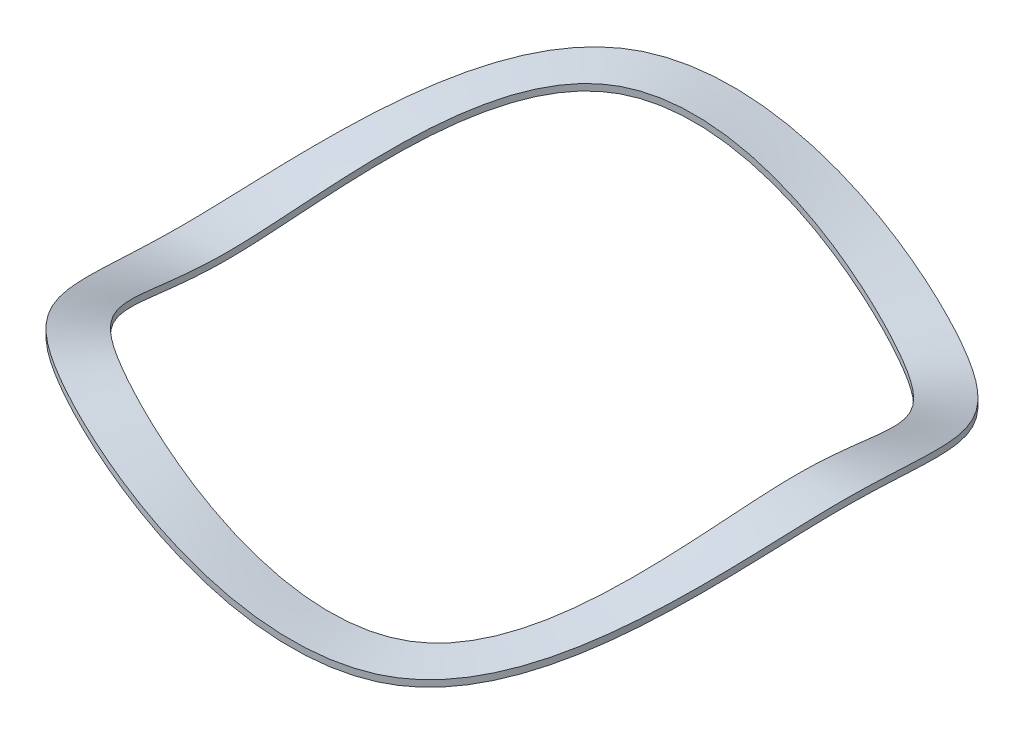
ISO-10303-21;
HEADER;
FILE_DESCRIPTION(('STEP AP214'),'2;1');
FILE_NAME('part.step','',(''),(''),'','','');
FILE_SCHEMA(('AUTOMOTIVE_DESIGN { 1 0 10303 214 1 1 1 1 }'));
ENDSEC;
DATA;
#1=APPLICATION_CONTEXT('core data for automotive mechanical design processes');
#2=APPLICATION_PROTOCOL_DEFINITION('international standard','automotive_design',2000,#1);
#3=PRODUCT_CONTEXT('',#1,'mechanical');
#4=PRODUCT('Part','Part','',(#3));
#5=PRODUCT_RELATED_PRODUCT_CATEGORY('part','',(#4));
#6=PRODUCT_DEFINITION_FORMATION('','',#4);
#7=PRODUCT_DEFINITION_CONTEXT('part definition',#1,'design');
#8=PRODUCT_DEFINITION('design','',#6,#7);
#9=PRODUCT_DEFINITION_SHAPE('','',#8);
#10=(LENGTH_UNIT() NAMED_UNIT(*) SI_UNIT(.MILLI.,.METRE.));
#11=(NAMED_UNIT(*) PLANE_ANGLE_UNIT() SI_UNIT($,.RADIAN.));
#12=(NAMED_UNIT(*) SI_UNIT($,.STERADIAN.) SOLID_ANGLE_UNIT());
#13=UNCERTAINTY_MEASURE_WITH_UNIT(LENGTH_MEASURE(1.E-05),#10,'distance_accuracy_value','');
#14=(GEOMETRIC_REPRESENTATION_CONTEXT(3) GLOBAL_UNCERTAINTY_ASSIGNED_CONTEXT((#13)) GLOBAL_UNIT_ASSIGNED_CONTEXT((#10,
#11,#12)) REPRESENTATION_CONTEXT('',''));
#15=CARTESIAN_POINT('',(0.,0.,0.));
#16=DIRECTION('',(0.,0.,1.));
#17=DIRECTION('',(1.,0.,0.));
#18=AXIS2_PLACEMENT_3D('',#15,#16,#17);
#19=CARTESIAN_POINT('',(-17.7546,0.,0.));
#20=CARTESIAN_POINT('',(-17.7546000000005,1.19396070179072E-12,-0.30751869268211));
#21=CARTESIAN_POINT('',(-17.7368454000016,0.0287020000037721,-0.922556078046613));
#22=CARTESIAN_POINT('',(-17.6582812950035,0.149250400008069,-1.84280576589896));
#23=CARTESIAN_POINT('',(-17.5291165800055,0.338683600012657,-2.75844267336164));
#24=CARTESIAN_POINT('',(-16.4585142000233,1.83692800003237,-8.21074909459633));
#25=CARTESIAN_POINT('',(-9.23239200016921,10.3327199999278,-18.4511215608123));
#26=CARTESIAN_POINT('',(10.6527600005029,-5.74040000001403,-18.4511215605249));
#27=CARTESIAN_POINT('',(21.3055199999069,11.4808000000723,-3.15599759867502E-10));
#28=CARTESIAN_POINT('',(10.6527600000534,-5.7403999999782,18.4511215608787));
#29=CARTESIAN_POINT('',(-9.23239200001469,10.3327200000052,18.4511215608173));
#30=CARTESIAN_POINT('',(-16.4585141999947,1.83692799998087,8.2107490945936));
#31=CARTESIAN_POINT('',(-17.529116579997,0.338683599991582,2.75844267335511));
#32=CARTESIAN_POINT('',(-17.6582812949977,0.149250399993841,1.84280576589605));
#33=CARTESIAN_POINT('',(-17.7368453999986,0.0287019999966051,0.922556078046043));
#34=CARTESIAN_POINT('',(-17.7545999999995,-1.19502626923836E-12,0.307518692682109));
#35=CARTESIAN_POINT('',(-17.7546,0.,0.));
#36=CARTESIAN_POINT('',(-17.9916666666667,0.,0.));
#37=CARTESIAN_POINT('',(-17.9916666666672,1.19396070179072E-12,-0.311624807796606));
#38=CARTESIAN_POINT('',(-17.9736750000016,0.0287020000037721,-0.934874423390106));
#39=CARTESIAN_POINT('',(-17.8940618750035,0.149250400008069,-1.8674116607226));
#40=CARTESIAN_POINT('',(-17.7631725000056,0.338683600012657,-2.79527452593872));
#41=CARTESIAN_POINT('',(-16.6782750000236,1.83692800003237,-8.32038236815317));
#42=CARTESIAN_POINT('',(-9.35566666683814,10.3327199999278,-18.6974884676806));
#43=CARTESIAN_POINT('',(10.7950000005096,-5.74040000001403,-18.6974884673893));
#44=CARTESIAN_POINT('',(21.5899999999056,11.4808000000723,-3.19814677128202E-10));
#45=CARTESIAN_POINT('',(10.7950000000541,-5.7403999999782,18.6974884677478));
#46=CARTESIAN_POINT('',(-9.35566666668156,10.3327200000052,18.6974884676856));
#47=CARTESIAN_POINT('',(-16.6782749999946,1.83692799998087,8.3203823681504));
#48=CARTESIAN_POINT('',(-17.763172499997,0.338683599991582,2.7952745259321));
#49=CARTESIAN_POINT('',(-17.8940618749976,0.149250399993841,1.86741166071965));
#50=CARTESIAN_POINT('',(-17.9736749999986,0.0287019999966051,0.934874423389529));
#51=CARTESIAN_POINT('',(-17.9916666666662,-1.19502626923836E-12,0.311624807796605));
#52=CARTESIAN_POINT('',(-17.9916666666667,0.,0.));
#53=CARTESIAN_POINT('',(-18.4658,0.,0.));
#54=CARTESIAN_POINT('',(-18.4658000000005,1.1943672776054E-12,-0.3198370380256));
#55=CARTESIAN_POINT('',(-18.4473342000017,0.0287020000037725,-0.959511114077094));
#56=CARTESIAN_POINT('',(-18.3656230350037,0.149250400008069,-1.91662345036989));
#57=CARTESIAN_POINT('',(-18.2312843400057,0.338683600012657,-2.86893823109287));
#58=CARTESIAN_POINT('',(-17.1177966000243,1.83692800003237,-8.53964891526687));
#59=CARTESIAN_POINT('',(-9.60221600017598,10.3327199999278,-19.1902222814171));
#60=CARTESIAN_POINT('',(11.079480000523,-5.74040000001403,-19.1902222811182));
#61=CARTESIAN_POINT('',(22.1589599999032,11.4808000000723,-3.28234916460377E-10));
#62=CARTESIAN_POINT('',(11.0794800000555,-5.7403999999782,19.1902222814862));
#63=CARTESIAN_POINT('',(-9.60221600001526,10.3327200000052,19.1902222814223));
#64=CARTESIAN_POINT('',(-17.1177965999945,1.83692799998087,8.53964891526403));
#65=CARTESIAN_POINT('',(-18.2312843399969,0.338683599991583,2.86893823108608));
#66=CARTESIAN_POINT('',(-18.3656230349976,0.149250399993842,1.91662345036685));
#67=CARTESIAN_POINT('',(-18.4473341999986,0.0287019999966055,0.959511114076502));
#68=CARTESIAN_POINT('',(-18.4657999999995,-1.19460952902831E-12,0.319837038025599));
#69=CARTESIAN_POINT('',(-18.4658,0.,0.));
#70=CARTESIAN_POINT('',(-19.177,0.,0.));
#71=CARTESIAN_POINT('',(-19.1770000000005,1.1943672776054E-12,-0.332155383369088));
#72=CARTESIAN_POINT('',(-19.1578230000017,0.0287020000037725,-0.996466150107571));
#73=CARTESIAN_POINT('',(-19.0729647750038,0.149250400008069,-1.9904411348408));
#74=CARTESIAN_POINT('',(-18.9334521000059,0.338683600012657,-2.97943378882409));
#75=CARTESIAN_POINT('',(-17.7770790000251,1.83692800003237,-8.86854873593737));
#76=CARTESIAN_POINT('',(-9.97204000018276,10.3327199999278,-19.9293230020218));
#77=CARTESIAN_POINT('',(11.5062000005432,-5.74040000001403,-19.9293230017114));
#78=CARTESIAN_POINT('',(23.0123999998994,11.4808000000723,-3.40897123897455E-10));
#79=CARTESIAN_POINT('',(11.5062000000577,-5.7403999999782,19.9293230020936));
#80=CARTESIAN_POINT('',(-9.97204000001588,10.3327200000052,19.9293230020272));
#81=CARTESIAN_POINT('',(-17.7770789999942,1.83692799998087,8.86854873593441));
#82=CARTESIAN_POINT('',(-18.9334520999968,0.338683599991583,2.97943378881703));
#83=CARTESIAN_POINT('',(-19.0729647749975,0.149250399993842,1.99044113483764));
#84=CARTESIAN_POINT('',(-19.1578229999985,0.0287019999966055,0.996466150106954));
#85=CARTESIAN_POINT('',(-19.1769999999994,-1.19460952902831E-12,0.332155383369087));
#86=CARTESIAN_POINT('',(-19.177,0.,0.));
#87=CARTESIAN_POINT('',(-19.8882,0.,0.));
#88=CARTESIAN_POINT('',(-19.8882000000006,1.19461969342368E-12,-0.344473728712578));
#89=CARTESIAN_POINT('',(-19.8683118000018,0.0287020000037727,-1.03342118613805));
#90=CARTESIAN_POINT('',(-19.7803065150039,0.149250400008069,-2.06425881931172));
#91=CARTESIAN_POINT('',(-19.6356198600061,0.338683600012657,-3.08992934655532));
#92=CARTESIAN_POINT('',(-18.4363614000261,1.83692800003237,-9.19744855660791));
#93=CARTESIAN_POINT('',(-10.3418640001895,10.3327199999278,-20.6684237226266));
#94=CARTESIAN_POINT('',(11.9329200005633,-5.74040000001402,-20.6684237223047));
#95=CARTESIAN_POINT('',(23.8658399998957,11.4808000000723,-3.53515773512253E-10));
#96=CARTESIAN_POINT('',(11.9329200000598,-5.74039999997819,20.668423722701));
#97=CARTESIAN_POINT('',(-10.3418640000165,10.3327200000052,20.6684237226323));
#98=CARTESIAN_POINT('',(-18.436361399994,1.83692799998087,9.19744855660485));
#99=CARTESIAN_POINT('',(-19.6356198599967,0.338683599991583,3.089929346548));
#100=CARTESIAN_POINT('',(-19.7803065149974,0.149250399993842,2.06425881930845));
#101=CARTESIAN_POINT('',(-19.8683117999985,0.0287019999966058,1.03342118613741));
#102=CARTESIAN_POINT('',(-19.8881999999995,-1.1943367844193E-12,0.344473728712577));
#103=CARTESIAN_POINT('',(-19.8882,0.,0.));
#104=CARTESIAN_POINT('',(-20.3623333333333,0.,0.));
#105=CARTESIAN_POINT('',(-20.3623333333339,1.19396070179072E-12,-0.352685958941571));
#106=CARTESIAN_POINT('',(-20.3419710000018,0.0287020000037721,-1.05805787682504));
#107=CARTESIAN_POINT('',(-20.251867675004,0.149250400008069,-2.11347060895899));
#108=CARTESIAN_POINT('',(-20.1037317000063,0.338683600012657,-3.16359305170947));
#109=CARTESIAN_POINT('',(-18.8758830000267,1.83692800003237,-9.41671510372159));
#110=CARTESIAN_POINT('',(-10.5884133335274,10.3327199999278,-21.1611575363632));
#111=CARTESIAN_POINT('',(12.2174000005767,-5.74040000001403,-21.1611575360335));
#112=CARTESIAN_POINT('',(24.4347999998932,11.4808000000723,-3.61953793760056E-10));
#113=CARTESIAN_POINT('',(12.2174000000613,-5.7403999999782,21.1611575364393));
#114=CARTESIAN_POINT('',(-10.5884133333502,10.3327200000052,21.1611575363689));
#115=CARTESIAN_POINT('',(-18.8758829999939,1.83692799998087,9.41671510371846));
#116=CARTESIAN_POINT('',(-20.1037316999966,0.338683599991582,3.16359305170198));
#117=CARTESIAN_POINT('',(-20.2518676749973,0.149250399993841,2.11347060895565));
#118=CARTESIAN_POINT('',(-20.3419709999984,0.0287019999966051,1.05805787682438));
#119=CARTESIAN_POINT('',(-20.3623333333328,-1.19502626923836E-12,0.35268595894157));
#120=CARTESIAN_POINT('',(-20.3623333333333,0.,0.));
#121=CARTESIAN_POINT('',(-20.5994,0.,0.));
#122=CARTESIAN_POINT('',(-20.5994000000006,1.19502796330426E-12,-0.356792074056067));
#123=CARTESIAN_POINT('',(-20.5788006000019,0.0287020000037731,-1.07037622216853));
#124=CARTESIAN_POINT('',(-20.4876482550041,0.14925040000807,-2.13807650378263));
#125=CARTESIAN_POINT('',(-20.3377876200064,0.338683600012658,-3.20042490428654));
#126=CARTESIAN_POINT('',(-19.095643800027,1.83692800003237,-9.52634837727843));
#127=CARTESIAN_POINT('',(-10.7116880001963,10.3327199999278,-21.4075244432314));
#128=CARTESIAN_POINT('',(12.3596400005835,-5.74040000001403,-21.407524442898));
#129=CARTESIAN_POINT('',(24.719279999892,11.4808000000723,-3.66168006289344E-10));
#130=CARTESIAN_POINT('',(12.359640000062,-5.7403999999782,21.4075244433085));
#131=CARTESIAN_POINT('',(-10.711688000017,10.3327200000052,21.4075244432372));
#132=CARTESIAN_POINT('',(-19.0956437999938,1.83692799998087,9.52634837727526));
#133=CARTESIAN_POINT('',(-20.3377876199965,0.338683599991584,3.20042490427897));
#134=CARTESIAN_POINT('',(-20.4876482549973,0.149250399993843,2.13807650377925));
#135=CARTESIAN_POINT('',(-20.5788005999984,0.0287019999966063,1.07037622216787));
#136=CARTESIAN_POINT('',(-20.5993999999994,-1.19389971541851E-12,0.356792074056066));
#137=CARTESIAN_POINT('',(-20.5994,0.,0.));
#138=B_SPLINE_SURFACE_WITH_KNOTS('',3,3,((#19,#20,#21,#22,#23,#24,#25,#26,#27,#28,#29,#30,#31,
#32,#33,#34,#35),(#36,#37,#38,#39,#40,#41,#42,#43,#44,#45,#46,#47,#48,#49,#50,#51,#52),(#53,#54,
#55,#56,#57,#58,#59,#60,#61,#62,#63,#64,#65,#66,#67,#68,#69),(#70,#71,#72,#73,#74,#75,#76,#77,
#78,#79,#80,#81,#82,#83,#84,#85,#86),(#87,#88,#89,#90,#91,#92,#93,#94,#95,#96,#97,#98,#99,#100,
#101,#102,#103),(#104,#105,#106,#107,#108,#109,#110,#111,#112,#113,#114,#115,#116,#117,#118,
#119,#120),(#121,#122,#123,#124,#125,#126,#127,#128,#129,#130,#131,#132,#133,#134,#135,#136,
#137)),.UNSPECIFIED.,.F.,.T.,.F.,(4,1,1,1,4),(4,1,1,1,1,1,1,1,1,1,1,1,1,1,4),(0.111111111111111,
0.305555555555556,0.5,0.694444444444444,0.888888888888889),(0.,0.0083333333333333,
0.0166666666666666,0.0250000000000001,0.0333333333333334,0.166666666665794,0.333333333328583,
0.5,0.666666666666667,0.833333333333334,0.966666666666667,0.975,0.983333333333333,
0.991666666666667,1.),.UNSPECIFIED.);
#139=CARTESIAN_POINT('',(-17.7546,0.,0.));
#140=CARTESIAN_POINT('',(-17.7546000000005,1.19396070179072E-12,-0.30751869268211));
#141=CARTESIAN_POINT('',(-17.7368454000016,0.0287020000037721,-0.922556078046613));
#142=CARTESIAN_POINT('',(-17.6582812950035,0.149250400008069,-1.84280576589896));
#143=CARTESIAN_POINT('',(-17.5291165800055,0.338683600012657,-2.75844267336164));
#144=CARTESIAN_POINT('',(-16.4585142000233,1.83692800003237,-8.21074909459633));
#145=CARTESIAN_POINT('',(-9.23239200016921,10.3327199999278,-18.4511215608123));
#146=CARTESIAN_POINT('',(10.6527600005029,-5.74040000001403,-18.4511215605249));
#147=CARTESIAN_POINT('',(21.3055199999069,11.4808000000723,-3.15599759867502E-10));
#148=CARTESIAN_POINT('',(10.6527600000534,-5.7403999999782,18.4511215608787));
#149=CARTESIAN_POINT('',(-9.23239200001469,10.3327200000052,18.4511215608173));
#150=CARTESIAN_POINT('',(-16.4585141999947,1.83692799998087,8.2107490945936));
#151=CARTESIAN_POINT('',(-17.529116579997,0.338683599991582,2.75844267335511));
#152=CARTESIAN_POINT('',(-17.6582812949977,0.149250399993841,1.84280576589605));
#153=CARTESIAN_POINT('',(-17.7368453999986,0.0287019999966051,0.922556078046043));
#154=CARTESIAN_POINT('',(-17.7545999999995,-1.19502626923836E-12,0.307518692682109));
#155=CARTESIAN_POINT('',(-17.7546,0.,0.));
#156=B_SPLINE_CURVE_WITH_KNOTS('',3,(#139,#140,#141,#142,#143,#144,#145,#146,#147,#148,#149,
#150,#151,#152,#153,#154,#155),.UNSPECIFIED.,.T.,.F.,(4,1,1,1,1,1,1,1,1,1,1,1,1,1,4),(0.,
0.0083333333333333,0.0166666666666666,0.0250000000000001,0.0333333333333334,0.166666666665794,
0.333333333328583,0.5,0.666666666666667,0.833333333333334,0.966666666666667,0.975,
0.983333333333333,0.991666666666667,1.),.UNSPECIFIED.);
#157=CARTESIAN_POINT('',(-17.7546,0.,0.));
#158=VERTEX_POINT('',#157);
#159=EDGE_CURVE('E32',#158,#158,#156,.T.);
#160=CARTESIAN_POINT('',(-20.5994,0.,0.));
#161=CARTESIAN_POINT('',(-20.5994000000006,1.19502796330426E-12,-0.356792074056067));
#162=CARTESIAN_POINT('',(-20.5788006000019,0.0287020000037731,-1.07037622216853));
#163=CARTESIAN_POINT('',(-20.4876482550041,0.14925040000807,-2.13807650378263));
#164=CARTESIAN_POINT('',(-20.3377876200064,0.338683600012658,-3.20042490428654));
#165=CARTESIAN_POINT('',(-19.095643800027,1.83692800003237,-9.52634837727843));
#166=CARTESIAN_POINT('',(-10.7116880001963,10.3327199999278,-21.4075244432314));
#167=CARTESIAN_POINT('',(12.3596400005835,-5.74040000001403,-21.407524442898));
#168=CARTESIAN_POINT('',(24.719279999892,11.4808000000723,-3.66168006289344E-10));
#169=CARTESIAN_POINT('',(12.359640000062,-5.7403999999782,21.4075244433085));
#170=CARTESIAN_POINT('',(-10.711688000017,10.3327200000052,21.4075244432372));
#171=CARTESIAN_POINT('',(-19.0956437999938,1.83692799998087,9.52634837727526));
#172=CARTESIAN_POINT('',(-20.3377876199965,0.338683599991584,3.20042490427897));
#173=CARTESIAN_POINT('',(-20.4876482549973,0.149250399993843,2.13807650377925));
#174=CARTESIAN_POINT('',(-20.5788005999984,0.0287019999966063,1.07037622216787));
#175=CARTESIAN_POINT('',(-20.5993999999994,-1.19389971541851E-12,0.356792074056066));
#176=CARTESIAN_POINT('',(-20.5994,0.,0.));
#177=B_SPLINE_CURVE_WITH_KNOTS('',3,(#160,#161,#162,#163,#164,#165,#166,#167,#168,#169,#170,
#171,#172,#173,#174,#175,#176),.UNSPECIFIED.,.T.,.F.,(4,1,1,1,1,1,1,1,1,1,1,1,1,1,4),(0.,
0.0083333333333333,0.0166666666666666,0.0250000000000001,0.0333333333333334,0.166666666665794,
0.333333333328583,0.5,0.666666666666667,0.833333333333334,0.966666666666667,0.975,
0.983333333333333,0.991666666666667,1.),.UNSPECIFIED.);
#178=CARTESIAN_POINT('',(-20.5994,0.,0.));
#179=VERTEX_POINT('',#178);
#180=EDGE_CURVE('E21',#179,#179,#177,.F.);
#181=ORIENTED_EDGE('',*,*,#159,.F.);
#182=EDGE_LOOP('',(#181));
#183=FACE_BOUND('',#182,.T.);
#184=ORIENTED_EDGE('',*,*,#180,.F.);
#185=EDGE_LOOP('',(#184));
#186=FACE_BOUND('',#185,.T.);
#187=ADVANCED_FACE('F15',(#183,#186),#138,.T.);
#188=CARTESIAN_POINT('',(-20.5994,0.,0.));
#189=CARTESIAN_POINT('',(-20.5994000000006,1.19502796330426E-12,-0.356792074056067));
#190=CARTESIAN_POINT('',(-20.5788006000019,0.0287020000037731,-1.07037622216853));
#191=CARTESIAN_POINT('',(-20.4876482550041,0.14925040000807,-2.13807650378263));
#192=CARTESIAN_POINT('',(-20.3377876200064,0.338683600012658,-3.20042490428654));
#193=CARTESIAN_POINT('',(-19.095643800027,1.83692800003237,-9.52634837727843));
#194=CARTESIAN_POINT('',(-10.7116880001963,10.3327199999278,-21.4075244432314));
#195=CARTESIAN_POINT('',(12.3596400005835,-5.74040000001403,-21.407524442898));
#196=CARTESIAN_POINT('',(24.719279999892,11.4808000000723,-3.66168006289344E-10));
#197=CARTESIAN_POINT('',(12.359640000062,-5.7403999999782,21.4075244433085));
#198=CARTESIAN_POINT('',(-10.711688000017,10.3327200000052,21.4075244432372));
#199=CARTESIAN_POINT('',(-19.0956437999938,1.83692799998087,9.52634837727526));
#200=CARTESIAN_POINT('',(-20.3377876199965,0.338683599991584,3.20042490427897));
#201=CARTESIAN_POINT('',(-20.4876482549973,0.149250399993843,2.13807650377925));
#202=CARTESIAN_POINT('',(-20.5788005999984,0.0287019999966063,1.07037622216787));
#203=CARTESIAN_POINT('',(-20.5993999999994,-1.19389971541851E-12,0.356792074056066));
#204=CARTESIAN_POINT('',(-20.5994,0.,0.));
#205=CARTESIAN_POINT('',(-20.5994,0.0338666666666671,0.));
#206=CARTESIAN_POINT('',(-20.5994000000006,0.0338666666678616,-0.356792074056067));
#207=CARTESIAN_POINT('',(-20.5788006000019,0.0625686666704397,-1.07037622216853));
#208=CARTESIAN_POINT('',(-20.4876482550041,0.183117066674736,-2.13807650378263));
#209=CARTESIAN_POINT('',(-20.3377876200064,0.372550266679324,-3.20042490428654));
#210=CARTESIAN_POINT('',(-19.095643800027,1.87079466669903,-9.52634837727843));
#211=CARTESIAN_POINT('',(-10.7116880001963,10.3665866665945,-21.4075244432314));
#212=CARTESIAN_POINT('',(12.3596400005835,-5.70653333334736,-21.407524442898));
#213=CARTESIAN_POINT('',(24.7192799998919,11.514666666739,-3.66165864990053E-10));
#214=CARTESIAN_POINT('',(12.359640000062,-5.70653333331153,21.4075244433085));
#215=CARTESIAN_POINT('',(-10.711688000017,10.3665866666719,21.4075244432372));
#216=CARTESIAN_POINT('',(-19.0956437999938,1.87079466664753,9.52634837727526));
#217=CARTESIAN_POINT('',(-20.3377876199965,0.37255026665825,3.20042490427897));
#218=CARTESIAN_POINT('',(-20.4876482549973,0.183117066660509,2.13807650377925));
#219=CARTESIAN_POINT('',(-20.5788005999984,0.0625686666632728,1.07037622216787));
#220=CARTESIAN_POINT('',(-20.5993999999994,0.0338666666654726,0.356792074056066));
#221=CARTESIAN_POINT('',(-20.5994,0.0338666666666671,0.));
#222=CARTESIAN_POINT('',(-20.5994,0.101599999999999,0.));
#223=CARTESIAN_POINT('',(-20.5994000000006,0.101600000001194,-0.356792074056068));
#224=CARTESIAN_POINT('',(-20.5788006000019,0.130302000003772,-1.07037622216853));
#225=CARTESIAN_POINT('',(-20.4876482550041,0.250850400008069,-2.13807650378264));
#226=CARTESIAN_POINT('',(-20.3377876200064,0.440283600012657,-3.20042490428654));
#227=CARTESIAN_POINT('',(-19.0956438000271,1.93852800003237,-9.52634837727844));
#228=CARTESIAN_POINT('',(-10.7116880001963,10.4343199999278,-21.4075244432315));
#229=CARTESIAN_POINT('',(12.3596400005835,-5.63880000001403,-21.4075244428979));
#230=CARTESIAN_POINT('',(24.719279999892,11.5824000000723,-3.66185353524104E-10));
#231=CARTESIAN_POINT('',(12.359640000062,-5.6387999999782,21.4075244433085));
#232=CARTESIAN_POINT('',(-10.711688000017,10.4343200000052,21.4075244432372));
#233=CARTESIAN_POINT('',(-19.0956437999939,1.93852799998087,9.52634837727526));
#234=CARTESIAN_POINT('',(-20.3377876199966,0.440283599991583,3.20042490427897));
#235=CARTESIAN_POINT('',(-20.4876482549973,0.250850399993842,2.13807650377925));
#236=CARTESIAN_POINT('',(-20.5788005999985,0.130301999996605,1.07037622216787));
#237=CARTESIAN_POINT('',(-20.5993999999995,0.101599999998805,0.356792074056066));
#238=CARTESIAN_POINT('',(-20.5994,0.101599999999999,0.));
#239=CARTESIAN_POINT('',(-20.5994,0.2032,0.));
#240=CARTESIAN_POINT('',(-20.5994000000006,0.203200000001195,-0.356792074056068));
#241=CARTESIAN_POINT('',(-20.5788006000018,0.231902000003773,-1.07037622216853));
#242=CARTESIAN_POINT('',(-20.487648255004,0.35245040000807,-2.13807650378263));
#243=CARTESIAN_POINT('',(-20.3377876200063,0.541883600012657,-3.20042490428654));
#244=CARTESIAN_POINT('',(-19.095643800027,2.04012800003237,-9.52634837727842));
#245=CARTESIAN_POINT('',(-10.7116880001963,10.5359199999278,-21.4075244432314));
#246=CARTESIAN_POINT('',(12.3596400005835,-5.53720000001403,-21.407524442898));
#247=CARTESIAN_POINT('',(24.7192799998919,11.6840000000724,-3.66146268035786E-10));
#248=CARTESIAN_POINT('',(12.359640000062,-5.5371999999782,21.4075244433084));
#249=CARTESIAN_POINT('',(-10.7116880000171,10.5359200000052,21.4075244432372));
#250=CARTESIAN_POINT('',(-19.0956437999938,2.04012799998087,9.52634837727526));
#251=CARTESIAN_POINT('',(-20.3377876199965,0.541883599991583,3.20042490427896));
#252=CARTESIAN_POINT('',(-20.4876482549973,0.352450399993842,2.13807650377925));
#253=CARTESIAN_POINT('',(-20.5788005999984,0.231901999996606,1.07037622216787));
#254=CARTESIAN_POINT('',(-20.5993999999994,0.203199999998806,0.356792074056066));
#255=CARTESIAN_POINT('',(-20.5994,0.2032,0.));
#256=CARTESIAN_POINT('',(-20.5994,0.304799999999999,0.));
#257=CARTESIAN_POINT('',(-20.5994000000006,0.304800000001194,-0.356792074056067));
#258=CARTESIAN_POINT('',(-20.5788006000019,0.333502000003772,-1.07037622216853));
#259=CARTESIAN_POINT('',(-20.4876482550041,0.454050400008068,-2.13807650378263));
#260=CARTESIAN_POINT('',(-20.3377876200064,0.643483600012656,-3.20042490428654));
#261=CARTESIAN_POINT('',(-19.0956438000271,2.14172800003237,-9.52634837727844));
#262=CARTESIAN_POINT('',(-10.7116880001963,10.6375199999278,-21.4075244432315));
#263=CARTESIAN_POINT('',(12.3596400005835,-5.43560000001403,-21.4075244428979));
#264=CARTESIAN_POINT('',(24.719279999892,11.7856000000723,-3.66186925617254E-10));
#265=CARTESIAN_POINT('',(12.359640000062,-5.4355999999782,21.4075244433085));
#266=CARTESIAN_POINT('',(-10.711688000017,10.6375200000052,21.4075244432372));
#267=CARTESIAN_POINT('',(-19.0956437999938,2.14172799998087,9.52634837727526));
#268=CARTESIAN_POINT('',(-20.3377876199966,0.643483599991582,3.20042490427897));
#269=CARTESIAN_POINT('',(-20.4876482549973,0.454050399993841,2.13807650377925));
#270=CARTESIAN_POINT('',(-20.5788005999984,0.333501999996605,1.07037622216787));
#271=CARTESIAN_POINT('',(-20.5993999999994,0.304799999998805,0.356792074056067));
#272=CARTESIAN_POINT('',(-20.5994,0.304799999999999,0.));
#273=CARTESIAN_POINT('',(-20.5994,0.372533333333333,0.));
#274=CARTESIAN_POINT('',(-20.5994000000006,0.372533333334528,-0.356792074056067));
#275=CARTESIAN_POINT('',(-20.5788006000019,0.401235333337106,-1.07037622216853));
#276=CARTESIAN_POINT('',(-20.4876482550041,0.521783733341403,-2.13807650378263));
#277=CARTESIAN_POINT('',(-20.3377876200064,0.711216933345991,-3.20042490428654));
#278=CARTESIAN_POINT('',(-19.095643800027,2.2094613333657,-9.52634837727843));
#279=CARTESIAN_POINT('',(-10.7116880001963,10.7052533332611,-21.4075244432314));
#280=CARTESIAN_POINT('',(12.3596400005835,-5.3678666666807,-21.407524442898));
#281=CARTESIAN_POINT('',(24.7192799998919,11.8533333334057,-3.66165864990053E-10));
#282=CARTESIAN_POINT('',(12.359640000062,-5.36786666664486,21.4075244433085));
#283=CARTESIAN_POINT('',(-10.711688000017,10.7052533333385,21.4075244432372));
#284=CARTESIAN_POINT('',(-19.0956437999938,2.2094613333142,9.52634837727526));
#285=CARTESIAN_POINT('',(-20.3377876199965,0.711216933324916,3.20042490427897));
#286=CARTESIAN_POINT('',(-20.4876482549973,0.521783733327176,2.13807650377925));
#287=CARTESIAN_POINT('',(-20.5788005999984,0.401235333329939,1.07037622216787));
#288=CARTESIAN_POINT('',(-20.5993999999994,0.372533333332139,0.356792074056066));
#289=CARTESIAN_POINT('',(-20.5994,0.372533333333333,0.));
#290=CARTESIAN_POINT('',(-20.5994,0.406399999999999,0.));
#291=CARTESIAN_POINT('',(-20.5994000000006,0.406400000001194,-0.356792074056068));
#292=CARTESIAN_POINT('',(-20.5788006000019,0.435102000003772,-1.07037622216853));
#293=CARTESIAN_POINT('',(-20.4876482550041,0.555650400008069,-2.13807650378263));
#294=CARTESIAN_POINT('',(-20.3377876200064,0.745083600012656,-3.20042490428654));
#295=CARTESIAN_POINT('',(-19.095643800027,2.24332800003237,-9.52634837727843));
#296=CARTESIAN_POINT('',(-10.7116880001963,10.7391199999278,-21.4075244432314));
#297=CARTESIAN_POINT('',(12.3596400005835,-5.33400000001403,-21.407524442898));
#298=CARTESIAN_POINT('',(24.719279999892,11.8872000000723,-3.66168765230865E-10));
#299=CARTESIAN_POINT('',(12.359640000062,-5.3339999999782,21.4075244433085));
#300=CARTESIAN_POINT('',(-10.711688000017,10.7391200000052,21.4075244432372));
#301=CARTESIAN_POINT('',(-19.0956437999938,2.24332799998087,9.52634837727526));
#302=CARTESIAN_POINT('',(-20.3377876199965,0.745083599991582,3.20042490427896));
#303=CARTESIAN_POINT('',(-20.4876482549973,0.555650399993841,2.13807650377925));
#304=CARTESIAN_POINT('',(-20.5788005999984,0.435101999996605,1.07037622216787));
#305=CARTESIAN_POINT('',(-20.5993999999994,0.406399999998805,0.356792074056065));
#306=CARTESIAN_POINT('',(-20.5994,0.406399999999999,0.));
#307=B_SPLINE_SURFACE_WITH_KNOTS('',3,3,((#188,#189,#190,#191,#192,#193,#194,#195,#196,#197,
#198,#199,#200,#201,#202,#203,#204),(#205,#206,#207,#208,#209,#210,#211,#212,#213,#214,#215,
#216,#217,#218,#219,#220,#221),(#222,#223,#224,#225,#226,#227,#228,#229,#230,#231,#232,#233,
#234,#235,#236,#237,#238),(#239,#240,#241,#242,#243,#244,#245,#246,#247,#248,#249,#250,#251,
#252,#253,#254,#255),(#256,#257,#258,#259,#260,#261,#262,#263,#264,#265,#266,#267,#268,#269,
#270,#271,#272),(#273,#274,#275,#276,#277,#278,#279,#280,#281,#282,#283,#284,#285,#286,#287,
#288,#289),(#290,#291,#292,#293,#294,#295,#296,#297,#298,#299,#300,#301,#302,#303,#304,#305,
#306)),.UNSPECIFIED.,.F.,.T.,.F.,(4,1,1,1,4),(4,1,1,1,1,1,1,1,1,1,1,1,1,1,4),(0.888888888888889,
0.916666666666667,0.944444444444444,0.972222222222222,1.),(0.,0.0083333333333333,
0.0166666666666666,0.0250000000000001,0.0333333333333334,0.166666666665794,0.333333333328583,
0.5,0.666666666666667,0.833333333333334,0.966666666666667,0.975,0.983333333333333,
0.991666666666667,1.),.UNSPECIFIED.);
#308=CARTESIAN_POINT('',(-20.5994,0.4064,0.));
#309=CARTESIAN_POINT('',(-20.5994000000006,0.406400000001195,-0.356792074056068));
#310=CARTESIAN_POINT('',(-20.5788006000019,0.435102000003773,-1.07037622216853));
#311=CARTESIAN_POINT('',(-20.4876482550041,0.555650400008069,-2.13807650378263));
#312=CARTESIAN_POINT('',(-20.3377876200064,0.745083600012657,-3.20042490428654));
#313=CARTESIAN_POINT('',(-19.095643800027,2.24332800003237,-9.52634837727843));
#314=CARTESIAN_POINT('',(-10.7116880001963,10.7391199999278,-21.4075244432314));
#315=CARTESIAN_POINT('',(12.3596400005835,-5.33400000001403,-21.407524442898));
#316=CARTESIAN_POINT('',(24.719279999892,11.8872000000723,-3.66168765230865E-10));
#317=CARTESIAN_POINT('',(12.359640000062,-5.3339999999782,21.4075244433085));
#318=CARTESIAN_POINT('',(-10.711688000017,10.7391200000052,21.4075244432372));
#319=CARTESIAN_POINT('',(-19.0956437999938,2.24332799998087,9.52634837727526));
#320=CARTESIAN_POINT('',(-20.3377876199965,0.745083599991583,3.20042490427896));
#321=CARTESIAN_POINT('',(-20.4876482549973,0.555650399993842,2.13807650377925));
#322=CARTESIAN_POINT('',(-20.5788005999984,0.435101999996606,1.07037622216787));
#323=CARTESIAN_POINT('',(-20.5993999999994,0.406399999998806,0.356792074056065));
#324=CARTESIAN_POINT('',(-20.5994,0.4064,0.));
#325=B_SPLINE_CURVE_WITH_KNOTS('',3,(#308,#309,#310,#311,#312,#313,#314,#315,#316,#317,#318,
#319,#320,#321,#322,#323,#324),.UNSPECIFIED.,.T.,.F.,(4,1,1,1,1,1,1,1,1,1,1,1,1,1,4),(0.,
0.0083333333333333,0.0166666666666666,0.0250000000000001,0.0333333333333334,0.166666666665794,
0.333333333328583,0.5,0.666666666666667,0.833333333333334,0.966666666666667,0.975,
0.983333333333333,0.991666666666667,1.),.UNSPECIFIED.);
#326=CARTESIAN_POINT('',(-20.5994,0.4064,0.));
#327=VERTEX_POINT('',#326);
#328=EDGE_CURVE('E27',#327,#327,#325,.F.);
#329=ORIENTED_EDGE('',*,*,#180,.T.);
#330=EDGE_LOOP('',(#329));
#331=FACE_BOUND('',#330,.T.);
#332=ORIENTED_EDGE('',*,*,#328,.F.);
#333=EDGE_LOOP('',(#332));
#334=FACE_BOUND('',#333,.T.);
#335=ADVANCED_FACE('F55',(#331,#334),#307,.T.);
#336=CARTESIAN_POINT('',(-17.7546,0.406399999999999,0.));
#337=CARTESIAN_POINT('',(-17.7546000000005,0.406400000001194,-0.30751869268211));
#338=CARTESIAN_POINT('',(-17.7368454000016,0.435102000003772,-0.922556078046613));
#339=CARTESIAN_POINT('',(-17.6582812950035,0.555650400008069,-1.84280576589896));
#340=CARTESIAN_POINT('',(-17.5291165800055,0.745083600012656,-2.75844267336164));
#341=CARTESIAN_POINT('',(-16.4585142000233,2.24332800003237,-8.21074909459633));
#342=CARTESIAN_POINT('',(-9.23239200016921,10.7391199999278,-18.4511215608123));
#343=CARTESIAN_POINT('',(10.6527600005029,-5.33400000001403,-18.4511215605249));
#344=CARTESIAN_POINT('',(21.3055199999069,11.8872000000723,-3.15599705657393E-10));
#345=CARTESIAN_POINT('',(10.6527600000534,-5.3339999999782,18.4511215608787));
#346=CARTESIAN_POINT('',(-9.2323920000147,10.7391200000052,18.4511215608173));
#347=CARTESIAN_POINT('',(-16.4585141999947,2.24332799998087,8.2107490945936));
#348=CARTESIAN_POINT('',(-17.529116579997,0.745083599991582,2.75844267335511));
#349=CARTESIAN_POINT('',(-17.6582812949977,0.555650399993841,1.84280576589605));
#350=CARTESIAN_POINT('',(-17.7368453999986,0.435101999996605,0.922556078046043));
#351=CARTESIAN_POINT('',(-17.7545999999995,0.406399999998805,0.307518692682109));
#352=CARTESIAN_POINT('',(-17.7546,0.406399999999999,0.));
#353=CARTESIAN_POINT('',(-17.7546,0.372533333333333,0.));
#354=CARTESIAN_POINT('',(-17.7546000000005,0.372533333334528,-0.30751869268211));
#355=CARTESIAN_POINT('',(-17.7368454000016,0.401235333337106,-0.922556078046613));
#356=CARTESIAN_POINT('',(-17.6582812950035,0.521783733341402,-1.84280576589897));
#357=CARTESIAN_POINT('',(-17.5291165800055,0.71121693334599,-2.75844267336164));
#358=CARTESIAN_POINT('',(-16.4585142000233,2.2094613333657,-8.21074909459633));
#359=CARTESIAN_POINT('',(-9.23239200016921,10.7052533332611,-18.4511215608123));
#360=CARTESIAN_POINT('',(10.6527600005029,-5.3678666666807,-18.4511215605249));
#361=CARTESIAN_POINT('',(21.3055199999069,11.8533333334057,-3.15599678552339E-10));
#362=CARTESIAN_POINT('',(10.6527600000534,-5.36786666664486,18.4511215608787));
#363=CARTESIAN_POINT('',(-9.2323920000147,10.7052533333385,18.4511215608173));
#364=CARTESIAN_POINT('',(-16.4585141999947,2.2094613333142,8.2107490945936));
#365=CARTESIAN_POINT('',(-17.529116579997,0.711216933324916,2.75844267335511));
#366=CARTESIAN_POINT('',(-17.6582812949977,0.521783733327175,1.84280576589605));
#367=CARTESIAN_POINT('',(-17.7368453999986,0.401235333329939,0.922556078046043));
#368=CARTESIAN_POINT('',(-17.7545999999995,0.372533333332139,0.307518692682108));
#369=CARTESIAN_POINT('',(-17.7546,0.372533333333333,0.));
#370=CARTESIAN_POINT('',(-17.7546,0.3048,0.));
#371=CARTESIAN_POINT('',(-17.7546000000005,0.304800000001194,-0.30751869268211));
#372=CARTESIAN_POINT('',(-17.7368454000016,0.333502000003772,-0.922556078046613));
#373=CARTESIAN_POINT('',(-17.6582812950035,0.454050400008069,-1.84280576589896));
#374=CARTESIAN_POINT('',(-17.5291165800055,0.643483600012657,-2.75844267336164));
#375=CARTESIAN_POINT('',(-16.4585142000233,2.14172800003237,-8.21074909459633));
#376=CARTESIAN_POINT('',(-9.23239200016918,10.6375199999278,-18.4511215608123));
#377=CARTESIAN_POINT('',(10.6527600005029,-5.43560000001404,-18.4511215605248));
#378=CARTESIAN_POINT('',(21.3055199999069,11.7856000000724,-3.15606969811949E-10));
#379=CARTESIAN_POINT('',(10.6527600000534,-5.4355999999782,18.4511215608787));
#380=CARTESIAN_POINT('',(-9.23239200001467,10.6375200000052,18.4511215608173));
#381=CARTESIAN_POINT('',(-16.4585141999947,2.14172799998087,8.21074909459359));
#382=CARTESIAN_POINT('',(-17.529116579997,0.643483599991583,2.75844267335511));
#383=CARTESIAN_POINT('',(-17.6582812949977,0.454050399993842,1.84280576589605));
#384=CARTESIAN_POINT('',(-17.7368453999986,0.333501999996605,0.922556078046042));
#385=CARTESIAN_POINT('',(-17.7545999999995,0.304799999998805,0.307518692682108));
#386=CARTESIAN_POINT('',(-17.7546,0.3048,0.));
#387=CARTESIAN_POINT('',(-17.7546,0.203200000000001,0.));
#388=CARTESIAN_POINT('',(-17.7546000000005,0.203200000001196,-0.30751869268211));
#389=CARTESIAN_POINT('',(-17.7368454000016,0.231902000003774,-0.922556078046613));
#390=CARTESIAN_POINT('',(-17.6582812950035,0.352450400008071,-1.84280576589897));
#391=CARTESIAN_POINT('',(-17.5291165800055,0.541883600012659,-2.75844267336164));
#392=CARTESIAN_POINT('',(-16.4585142000233,2.04012800003237,-8.21074909459633));
#393=CARTESIAN_POINT('',(-9.23239200016925,10.5359199999278,-18.4511215608123));
#394=CARTESIAN_POINT('',(10.6527600005029,-5.53720000001403,-18.4511215605249));
#395=CARTESIAN_POINT('',(21.3055199999069,11.6840000000723,-3.15592820973598E-10));
#396=CARTESIAN_POINT('',(10.6527600000535,-5.53719999997819,18.4511215608787));
#397=CARTESIAN_POINT('',(-9.23239200001473,10.5359200000052,18.4511215608173));
#398=CARTESIAN_POINT('',(-16.4585141999947,2.04012799998087,8.21074909459361));
#399=CARTESIAN_POINT('',(-17.5291165799971,0.541883599991583,2.75844267335512));
#400=CARTESIAN_POINT('',(-17.6582812949977,0.352450399993842,1.84280576589605));
#401=CARTESIAN_POINT('',(-17.7368453999987,0.231901999996607,0.922556078046044));
#402=CARTESIAN_POINT('',(-17.7545999999995,0.203199999998807,0.307518692682109));
#403=CARTESIAN_POINT('',(-17.7546,0.203200000000001,0.));
#404=CARTESIAN_POINT('',(-17.7546,0.101599999999999,0.));
#405=CARTESIAN_POINT('',(-17.7546000000005,0.101600000001193,-0.30751869268211));
#406=CARTESIAN_POINT('',(-17.7368454000016,0.130302000003771,-0.922556078046613));
#407=CARTESIAN_POINT('',(-17.6582812950035,0.250850400008068,-1.84280576589896));
#408=CARTESIAN_POINT('',(-17.5291165800054,0.440283600012656,-2.75844267336164));
#409=CARTESIAN_POINT('',(-16.4585142000233,1.93852800003237,-8.21074909459633));
#410=CARTESIAN_POINT('',(-9.23239200016918,10.4343199999278,-18.4511215608123));
#411=CARTESIAN_POINT('',(10.6527600005029,-5.63880000001403,-18.4511215605248));
#412=CARTESIAN_POINT('',(21.3055199999068,11.5824000000723,-3.15611360830748E-10));
#413=CARTESIAN_POINT('',(10.6527600000534,-5.6387999999782,18.4511215608787));
#414=CARTESIAN_POINT('',(-9.23239200001467,10.4343200000052,18.4511215608172));
#415=CARTESIAN_POINT('',(-16.4585141999946,1.93852799998087,8.21074909459359));
#416=CARTESIAN_POINT('',(-17.529116579997,0.440283599991582,2.75844267335511));
#417=CARTESIAN_POINT('',(-17.6582812949976,0.250850399993841,1.84280576589605));
#418=CARTESIAN_POINT('',(-17.7368453999986,0.130301999996605,0.922556078046042));
#419=CARTESIAN_POINT('',(-17.7545999999995,0.101599999998805,0.307518692682108));
#420=CARTESIAN_POINT('',(-17.7546,0.101599999999999,0.));
#421=CARTESIAN_POINT('',(-17.7546,0.0338666666666667,0.));
#422=CARTESIAN_POINT('',(-17.7546000000005,0.0338666666678612,-0.30751869268211));
#423=CARTESIAN_POINT('',(-17.7368454000016,0.0625686666704393,-0.922556078046613));
#424=CARTESIAN_POINT('',(-17.6582812950035,0.183117066674736,-1.84280576589896));
#425=CARTESIAN_POINT('',(-17.5291165800055,0.372550266679324,-2.75844267336164));
#426=CARTESIAN_POINT('',(-16.4585142000233,1.87079466669904,-8.21074909459633));
#427=CARTESIAN_POINT('',(-9.23239200016921,10.3665866665945,-18.4511215608123));
#428=CARTESIAN_POINT('',(10.6527600005029,-5.70653333334736,-18.4511215605249));
#429=CARTESIAN_POINT('',(21.3055199999069,11.514666666739,-3.15599732762448E-10));
#430=CARTESIAN_POINT('',(10.6527600000534,-5.70653333331153,18.4511215608787));
#431=CARTESIAN_POINT('',(-9.23239200001469,10.3665866666719,18.4511215608173));
#432=CARTESIAN_POINT('',(-16.4585141999947,1.87079466664753,8.2107490945936));
#433=CARTESIAN_POINT('',(-17.529116579997,0.372550266658249,2.75844267335511));
#434=CARTESIAN_POINT('',(-17.6582812949977,0.183117066660509,1.84280576589605));
#435=CARTESIAN_POINT('',(-17.7368453999986,0.0625686666632723,0.922556078046043));
#436=CARTESIAN_POINT('',(-17.7545999999995,0.0338666666654722,0.307518692682108));
#437=CARTESIAN_POINT('',(-17.7546,0.0338666666666667,0.));
#438=CARTESIAN_POINT('',(-17.7546,0.,0.));
#439=CARTESIAN_POINT('',(-17.7546000000005,1.19396070179072E-12,-0.30751869268211));
#440=CARTESIAN_POINT('',(-17.7368454000016,0.0287020000037721,-0.922556078046613));
#441=CARTESIAN_POINT('',(-17.6582812950035,0.149250400008069,-1.84280576589896));
#442=CARTESIAN_POINT('',(-17.5291165800055,0.338683600012657,-2.75844267336164));
#443=CARTESIAN_POINT('',(-16.4585142000233,1.83692800003237,-8.21074909459633));
#444=CARTESIAN_POINT('',(-9.23239200016921,10.3327199999278,-18.4511215608123));
#445=CARTESIAN_POINT('',(10.6527600005029,-5.74040000001403,-18.4511215605249));
#446=CARTESIAN_POINT('',(21.3055199999069,11.4808000000723,-3.15599759867502E-10));
#447=CARTESIAN_POINT('',(10.6527600000534,-5.7403999999782,18.4511215608787));
#448=CARTESIAN_POINT('',(-9.23239200001469,10.3327200000052,18.4511215608173));
#449=CARTESIAN_POINT('',(-16.4585141999947,1.83692799998087,8.2107490945936));
#450=CARTESIAN_POINT('',(-17.529116579997,0.338683599991582,2.75844267335511));
#451=CARTESIAN_POINT('',(-17.6582812949977,0.149250399993841,1.84280576589605));
#452=CARTESIAN_POINT('',(-17.7368453999986,0.0287019999966051,0.922556078046043));
#453=CARTESIAN_POINT('',(-17.7545999999995,-1.19502626923836E-12,0.307518692682109));
#454=CARTESIAN_POINT('',(-17.7546,0.,0.));
#455=B_SPLINE_SURFACE_WITH_KNOTS('',3,3,((#336,#337,#338,#339,#340,#341,#342,#343,#344,#345,
#346,#347,#348,#349,#350,#351,#352),(#353,#354,#355,#356,#357,#358,#359,#360,#361,#362,#363,
#364,#365,#366,#367,#368,#369),(#370,#371,#372,#373,#374,#375,#376,#377,#378,#379,#380,#381,
#382,#383,#384,#385,#386),(#387,#388,#389,#390,#391,#392,#393,#394,#395,#396,#397,#398,#399,
#400,#401,#402,#403),(#404,#405,#406,#407,#408,#409,#410,#411,#412,#413,#414,#415,#416,#417,
#418,#419,#420),(#421,#422,#423,#424,#425,#426,#427,#428,#429,#430,#431,#432,#433,#434,#435,
#436,#437),(#438,#439,#440,#441,#442,#443,#444,#445,#446,#447,#448,#449,#450,#451,#452,#453,
#454)),.UNSPECIFIED.,.F.,.T.,.F.,(4,1,1,1,4),(4,1,1,1,1,1,1,1,1,1,1,1,1,1,4),(0.,
0.0277777777777778,0.0555555555555556,0.0833333333333333,0.111111111111111),(0.,
0.0083333333333333,0.0166666666666666,0.0250000000000001,0.0333333333333334,0.166666666665794,
0.333333333328583,0.5,0.666666666666667,0.833333333333334,0.966666666666667,0.975,
0.983333333333333,0.991666666666667,1.),.UNSPECIFIED.);
#456=CARTESIAN_POINT('',(-17.7546,0.4064,0.));
#457=CARTESIAN_POINT('',(-17.7546000000005,0.406400000001195,-0.30751869268211));
#458=CARTESIAN_POINT('',(-17.7368454000016,0.435102000003773,-0.922556078046613));
#459=CARTESIAN_POINT('',(-17.6582812950035,0.55565040000807,-1.84280576589896));
#460=CARTESIAN_POINT('',(-17.5291165800055,0.745083600012657,-2.75844267336164));
#461=CARTESIAN_POINT('',(-16.4585142000233,2.24332800003237,-8.21074909459633));
#462=CARTESIAN_POINT('',(-9.23239200016921,10.7391199999278,-18.4511215608123));
#463=CARTESIAN_POINT('',(10.6527600005029,-5.33400000001403,-18.4511215605249));
#464=CARTESIAN_POINT('',(21.3055199999069,11.8872000000723,-3.15599705657393E-10));
#465=CARTESIAN_POINT('',(10.6527600000534,-5.3339999999782,18.4511215608787));
#466=CARTESIAN_POINT('',(-9.2323920000147,10.7391200000052,18.4511215608173));
#467=CARTESIAN_POINT('',(-16.4585141999947,2.24332799998087,8.2107490945936));
#468=CARTESIAN_POINT('',(-17.529116579997,0.745083599991583,2.75844267335511));
#469=CARTESIAN_POINT('',(-17.6582812949977,0.555650399993842,1.84280576589605));
#470=CARTESIAN_POINT('',(-17.7368453999986,0.435101999996606,0.922556078046043));
#471=CARTESIAN_POINT('',(-17.7545999999995,0.406399999998806,0.307518692682109));
#472=CARTESIAN_POINT('',(-17.7546,0.4064,0.));
#473=B_SPLINE_CURVE_WITH_KNOTS('',3,(#456,#457,#458,#459,#460,#461,#462,#463,#464,#465,#466,
#467,#468,#469,#470,#471,#472),.UNSPECIFIED.,.T.,.F.,(4,1,1,1,1,1,1,1,1,1,1,1,1,1,4),(0.,
0.0083333333333333,0.0166666666666666,0.0250000000000001,0.0333333333333334,0.166666666665794,
0.333333333328583,0.5,0.666666666666667,0.833333333333334,0.966666666666667,0.975,
0.983333333333333,0.991666666666667,1.),.UNSPECIFIED.);
#474=CARTESIAN_POINT('',(-17.7546,0.4064,0.));
#475=VERTEX_POINT('',#474);
#476=EDGE_CURVE('E10',#475,#475,#473,.T.);
#477=ORIENTED_EDGE('',*,*,#159,.T.);
#478=EDGE_LOOP('',(#477));
#479=FACE_BOUND('',#478,.T.);
#480=ORIENTED_EDGE('',*,*,#476,.F.);
#481=EDGE_LOOP('',(#480));
#482=FACE_BOUND('',#481,.T.);
#483=ADVANCED_FACE('F65',(#479,#482),#455,.T.);
#484=CARTESIAN_POINT('',(-20.5994,0.4064,0.));
#485=CARTESIAN_POINT('',(-20.5994000000006,0.406400000001195,-0.356792074056068));
#486=CARTESIAN_POINT('',(-20.5788006000019,0.435102000003773,-1.07037622216853));
#487=CARTESIAN_POINT('',(-20.4876482550041,0.555650400008069,-2.13807650378263));
#488=CARTESIAN_POINT('',(-20.3377876200064,0.745083600012657,-3.20042490428654));
#489=CARTESIAN_POINT('',(-19.095643800027,2.24332800003237,-9.52634837727843));
#490=CARTESIAN_POINT('',(-10.7116880001963,10.7391199999278,-21.4075244432314));
#491=CARTESIAN_POINT('',(12.3596400005835,-5.33400000001403,-21.407524442898));
#492=CARTESIAN_POINT('',(24.719279999892,11.8872000000723,-3.66168765230865E-10));
#493=CARTESIAN_POINT('',(12.359640000062,-5.3339999999782,21.4075244433085));
#494=CARTESIAN_POINT('',(-10.711688000017,10.7391200000052,21.4075244432372));
#495=CARTESIAN_POINT('',(-19.0956437999938,2.24332799998087,9.52634837727526));
#496=CARTESIAN_POINT('',(-20.3377876199965,0.745083599991583,3.20042490427896));
#497=CARTESIAN_POINT('',(-20.4876482549973,0.555650399993842,2.13807650377925));
#498=CARTESIAN_POINT('',(-20.5788005999984,0.435101999996606,1.07037622216787));
#499=CARTESIAN_POINT('',(-20.5993999999994,0.406399999998806,0.356792074056065));
#500=CARTESIAN_POINT('',(-20.5994,0.4064,0.));
#501=CARTESIAN_POINT('',(-19.6511333333333,0.4064,0.));
#502=CARTESIAN_POINT('',(-19.6511333333339,0.406400000001195,-0.340367613598082));
#503=CARTESIAN_POINT('',(-19.6314822000018,0.435102000003773,-1.02110284079456));
#504=CARTESIAN_POINT('',(-19.5445259350039,0.555650400008069,-2.03965292448808));
#505=CARTESIAN_POINT('',(-19.4015639400061,0.745083600012657,-3.05309749397824));
#506=CARTESIAN_POINT('',(-18.2166006000258,2.24332800003237,-9.08781528305106));
#507=CARTESIAN_POINT('',(-10.2185893335206,10.7391199999278,-20.4220568157584));
#508=CARTESIAN_POINT('',(11.7906800005566,-5.33400000001403,-20.4220568154403));
#509=CARTESIAN_POINT('',(23.5813599998969,11.8872000000723,-3.49313812467514E-10));
#510=CARTESIAN_POINT('',(11.7906800000591,-5.3339999999782,20.4220568158319));
#511=CARTESIAN_POINT('',(-10.2185893333496,10.7391200000052,20.4220568157639));
#512=CARTESIAN_POINT('',(-18.2166005999941,2.24332799998087,9.08781528304804));
#513=CARTESIAN_POINT('',(-19.4015639399967,0.745083599991583,3.05309749397102));
#514=CARTESIAN_POINT('',(-19.5445259349974,0.555650399993842,2.03965292448485));
#515=CARTESIAN_POINT('',(-19.6314821999985,0.435101999996606,1.02110284079393));
#516=CARTESIAN_POINT('',(-19.6511333333328,0.406399999998806,0.34036761359808));
#517=CARTESIAN_POINT('',(-19.6511333333333,0.4064,0.));
#518=CARTESIAN_POINT('',(-18.7028666666667,0.4064,0.));
#519=CARTESIAN_POINT('',(-18.7028666666672,0.406400000001195,-0.323943153140095));
#520=CARTESIAN_POINT('',(-18.6841638000017,0.435102000003773,-0.971829459420585));
#521=CARTESIAN_POINT('',(-18.6014036150037,0.55565040000807,-1.94122934519352));
#522=CARTESIAN_POINT('',(-18.4653402600058,0.745083600012657,-2.90577008366994));
#523=CARTESIAN_POINT('',(-17.3375574000245,2.24332800003237,-8.6492821888237));
#524=CARTESIAN_POINT('',(-9.72549066684491,10.7391199999278,-19.4365891882853));
#525=CARTESIAN_POINT('',(11.2217200005297,-5.33400000001403,-19.4365891879826));
#526=CARTESIAN_POINT('',(22.4434399999019,11.8872000000723,-3.32455308942048E-10));
#527=CARTESIAN_POINT('',(11.2217200000563,-5.3339999999782,19.4365891883553));
#528=CARTESIAN_POINT('',(-9.72549066668215,10.7391200000052,19.4365891882906));
#529=CARTESIAN_POINT('',(-17.3375573999944,2.24332799998087,8.64928218882082));
#530=CARTESIAN_POINT('',(-18.4653402599969,0.745083599991583,2.90577008366306));
#531=CARTESIAN_POINT('',(-18.6014036149976,0.555650399993842,1.94122934519045));
#532=CARTESIAN_POINT('',(-18.6841637999986,0.435101999996606,0.971829459419986));
#533=CARTESIAN_POINT('',(-18.7028666666662,0.406399999998806,0.323943153140095));
#534=CARTESIAN_POINT('',(-18.7028666666667,0.4064,0.));
#535=CARTESIAN_POINT('',(-17.7546,0.4064,0.));
#536=CARTESIAN_POINT('',(-17.7546000000005,0.406400000001195,-0.30751869268211));
#537=CARTESIAN_POINT('',(-17.7368454000016,0.435102000003773,-0.922556078046613));
#538=CARTESIAN_POINT('',(-17.6582812950035,0.55565040000807,-1.84280576589896));
#539=CARTESIAN_POINT('',(-17.5291165800055,0.745083600012657,-2.75844267336164));
#540=CARTESIAN_POINT('',(-16.4585142000233,2.24332800003237,-8.21074909459633));
#541=CARTESIAN_POINT('',(-9.23239200016921,10.7391199999278,-18.4511215608123));
#542=CARTESIAN_POINT('',(10.6527600005029,-5.33400000001403,-18.4511215605249));
#543=CARTESIAN_POINT('',(21.3055199999069,11.8872000000723,-3.15599705657393E-10));
#544=CARTESIAN_POINT('',(10.6527600000534,-5.3339999999782,18.4511215608787));
#545=CARTESIAN_POINT('',(-9.2323920000147,10.7391200000052,18.4511215608173));
#546=CARTESIAN_POINT('',(-16.4585141999947,2.24332799998087,8.2107490945936));
#547=CARTESIAN_POINT('',(-17.529116579997,0.745083599991583,2.75844267335511));
#548=CARTESIAN_POINT('',(-17.6582812949977,0.555650399993842,1.84280576589605));
#549=CARTESIAN_POINT('',(-17.7368453999986,0.435101999996606,0.922556078046043));
#550=CARTESIAN_POINT('',(-17.7545999999995,0.406399999998806,0.307518692682109));
#551=CARTESIAN_POINT('',(-17.7546,0.4064,0.));
#552=B_SPLINE_SURFACE_WITH_KNOTS('',3,3,((#484,#485,#486,#487,#488,#489,#490,#491,#492,#493,
#494,#495,#496,#497,#498,#499,#500),(#501,#502,#503,#504,#505,#506,#507,#508,#509,#510,#511,
#512,#513,#514,#515,#516,#517),(#518,#519,#520,#521,#522,#523,#524,#525,#526,#527,#528,#529,
#530,#531,#532,#533,#534),(#535,#536,#537,#538,#539,#540,#541,#542,#543,#544,#545,#546,#547,
#548,#549,#550,#551)),.UNSPECIFIED.,.F.,.T.,.F.,(4,4),(4,1,1,1,1,1,1,1,1,1,1,1,1,1,4),(0.,1.),
(0.,0.0083333333333333,0.0166666666666666,0.0250000000000001,0.0333333333333334,
0.166666666665794,0.333333333328583,0.5,0.666666666666667,0.833333333333334,0.966666666666667,
0.975,0.983333333333333,0.991666666666667,1.),.UNSPECIFIED.);
#553=ORIENTED_EDGE('',*,*,#328,.T.);
#554=EDGE_LOOP('',(#553));
#555=FACE_BOUND('',#554,.T.);
#556=ORIENTED_EDGE('',*,*,#476,.T.);
#557=EDGE_LOOP('',(#556));
#558=FACE_BOUND('',#557,.T.);
#559=ADVANCED_FACE('F17',(#555,#558),#552,.T.);
#560=CLOSED_SHELL('',(#187,#335,#483,#559));
#561=MANIFOLD_SOLID_BREP('B1',#560);
#562=ADVANCED_BREP_SHAPE_REPRESENTATION('',(#18,#561),#14);
#563=SHAPE_DEFINITION_REPRESENTATION(#9,#562);
ENDSEC;
END-ISO-10303-21;
